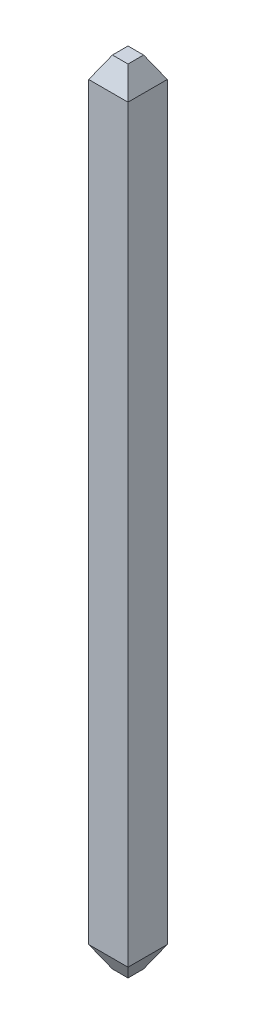
ISO-10303-21;
HEADER;
FILE_DESCRIPTION(('STEP AP214'),'2;1');
FILE_NAME('part.step','',(''),(''),'','','');
FILE_SCHEMA(('AUTOMOTIVE_DESIGN { 1 0 10303 214 1 1 1 1 }'));
ENDSEC;
DATA;
#1=APPLICATION_CONTEXT('core data for automotive mechanical design processes');
#2=APPLICATION_PROTOCOL_DEFINITION('international standard','automotive_design',2000,#1);
#3=PRODUCT_CONTEXT('',#1,'mechanical');
#4=PRODUCT('Part','Part','',(#3));
#5=PRODUCT_RELATED_PRODUCT_CATEGORY('part','',(#4));
#6=PRODUCT_DEFINITION_FORMATION('','',#4);
#7=PRODUCT_DEFINITION_CONTEXT('part definition',#1,'design');
#8=PRODUCT_DEFINITION('design','',#6,#7);
#9=PRODUCT_DEFINITION_SHAPE('','',#8);
#10=(LENGTH_UNIT() NAMED_UNIT(*) SI_UNIT(.MILLI.,.METRE.));
#11=(NAMED_UNIT(*) PLANE_ANGLE_UNIT() SI_UNIT($,.RADIAN.));
#12=(NAMED_UNIT(*) SI_UNIT($,.STERADIAN.) SOLID_ANGLE_UNIT());
#13=UNCERTAINTY_MEASURE_WITH_UNIT(LENGTH_MEASURE(1.E-05),#10,'distance_accuracy_value','');
#14=(GEOMETRIC_REPRESENTATION_CONTEXT(3) GLOBAL_UNCERTAINTY_ASSIGNED_CONTEXT((#13)) GLOBAL_UNIT_ASSIGNED_CONTEXT((#10,
#11,#12)) REPRESENTATION_CONTEXT('',''));
#15=CARTESIAN_POINT('',(0.,0.,0.));
#16=DIRECTION('',(0.,0.,1.));
#17=DIRECTION('',(1.,0.,0.));
#18=AXIS2_PLACEMENT_3D('',#15,#16,#17);
#19=CARTESIAN_POINT('',(0.497289871213,-21.22226807941,9.869039407632));
#20=DIRECTION('',(0.,0.488489958076213,0.87256951634738));
#21=DIRECTION('',(0.,-0.87256951634738,0.488489958076213));
#22=AXIS2_PLACEMENT_3D('',#19,#20,#21);
#23=PLANE('',#22);
#24=DIRECTION('',(1.,0.,0.));
#25=VECTOR('',#24,1.);
#26=CARTESIAN_POINT('',(0.497289871213,-21.57099360271,10.0642661638579));
#27=LINE('',#26,#25);
#28=CARTESIAN_POINT('',(0.48728989589798,-21.5709939289416,10.0642661638454));
#29=VERTEX_POINT('',#28);
#30=CARTESIAN_POINT('',(-0.142710289145667,-21.5709938896675,10.0642663245045));
#31=VERTEX_POINT('',#30);
#32=EDGE_CURVE('E118',#29,#31,#27,.F.);
#33=ORIENTED_EDGE('',*,*,#32,.F.);
#34=DIRECTION('',(0.438284036988266,-0.784297353956642,0.439072617567844));
#35=VECTOR('',#34,1.);
#36=CARTESIAN_POINT('',(0.29728987121219,-21.2309937745705,9.873924307213));
#37=LINE('',#36,#35);
#38=CARTESIAN_POINT('',(0.297289871212797,-21.2309937745703,9.87392430721258));
#39=VERTEX_POINT('',#38);
#40=EDGE_CURVE('E116',#39,#29,#37,.T.);
#41=ORIENTED_EDGE('',*,*,#40,.F.);
#42=DIRECTION('',(-1.,0.,0.));
#43=VECTOR('',#42,1.);
#44=CARTESIAN_POINT('',(0.307289871213,-21.23099377457,9.873924307213));
#45=LINE('',#44,#43);
#46=CARTESIAN_POINT('',(0.0472898712130297,-21.2309937745702,9.87392430721258));
#47=VERTEX_POINT('',#46);
#48=EDGE_CURVE('E79',#47,#39,#45,.F.);
#49=ORIENTED_EDGE('',*,*,#48,.F.);
#50=DIRECTION('',(0.438284036988272,0.784297353956654,-0.439072617567815));
#51=VECTOR('',#50,1.);
#52=CARTESIAN_POINT('',(-0.14271012878781,-21.5709936027095,10.064266163858));
#53=LINE('',#52,#51);
#54=EDGE_CURVE('E110',#31,#47,#53,.T.);
#55=ORIENTED_EDGE('',*,*,#54,.F.);
#56=EDGE_LOOP('',(#33,#41,#49,#55));
#57=FACE_BOUND('',#56,.T.);
#58=ADVANCED_FACE('F17',(#57),#23,.T.);
#59=CARTESIAN_POINT('',(0.497289871213,-33.93541112064,9.869291335356));
#60=DIRECTION('',(0.,-0.487152273933216,0.873317045523387));
#61=DIRECTION('',(0.,-0.873317045523387,-0.487152273933216));
#62=AXIS2_PLACEMENT_3D('',#59,#60,#61);
#63=PLANE('',#62);
#64=DIRECTION('',(-0.438586917260297,-0.784839349958943,-0.437799852403052));
#65=VECTOR('',#64,1.);
#66=CARTESIAN_POINT('',(0.487290184384019,-33.5866775616409,10.063822206765));
#67=LINE('',#66,#65);
#68=CARTESIAN_POINT('',(0.487289980136551,-33.5866774630266,10.0638219617617));
#69=VERTEX_POINT('',#68);
#70=CARTESIAN_POINT('',(0.29728987121302,-33.9266779501895,9.87416285809402));
#71=VERTEX_POINT('',#70);
#72=EDGE_CURVE('E122',#69,#71,#67,.T.);
#73=ORIENTED_EDGE('',*,*,#72,.F.);
#74=DIRECTION('',(1.,0.,0.));
#75=VECTOR('',#74,1.);
#76=CARTESIAN_POINT('',(0.497289871213,-33.5866774970136,10.0638228462197));
#77=LINE('',#76,#75);
#78=CARTESIAN_POINT('',(-0.142710305819022,-33.5866774872793,10.0638219600164));
#79=VERTEX_POINT('',#78);
#80=EDGE_CURVE('E89',#79,#69,#77,.T.);
#81=ORIENTED_EDGE('',*,*,#80,.F.);
#82=DIRECTION('',(-0.438586917260198,0.784839349958761,0.437799852403477));
#83=VECTOR('',#82,1.);
#84=CARTESIAN_POINT('',(0.0472898712136261,-33.9266779501897,9.874162858095));
#85=LINE('',#84,#83);
#86=CARTESIAN_POINT('',(0.0472898712132013,-33.9266779501894,9.87416285809402));
#87=VERTEX_POINT('',#86);
#88=EDGE_CURVE('E84',#87,#79,#85,.T.);
#89=ORIENTED_EDGE('',*,*,#88,.F.);
#90=DIRECTION('',(1.,0.,0.));
#91=VECTOR('',#90,1.);
#92=CARTESIAN_POINT('',(0.03728987121306,-33.92667795019,9.874162858095));
#93=LINE('',#92,#91);
#94=EDGE_CURVE('E20',#71,#87,#93,.F.);
#95=ORIENTED_EDGE('',*,*,#94,.F.);
#96=EDGE_LOOP('',(#73,#81,#89,#95));
#97=FACE_BOUND('',#96,.T.);
#98=ADVANCED_FACE('F86',(#97),#63,.T.);
#99=CARTESIAN_POINT('',(0.03728987121306,-33.92667795019,9.614162858095));
#100=DIRECTION('',(0.,-1.,0.));
#101=DIRECTION('',(1.,0.,0.));
#102=AXIS2_PLACEMENT_3D('',#99,#100,#101);
#103=PLANE('',#102);
#104=DIRECTION('',(0.,0.,1.));
#105=VECTOR('',#104,1.);
#106=CARTESIAN_POINT('',(0.0472898712136262,-33.9266779501897,9.423821001451));
#107=LINE('',#106,#105);
#108=CARTESIAN_POINT('',(0.0472898712133431,-33.9266779501896,9.62416285809542));
#109=VERTEX_POINT('',#108);
#110=EDGE_CURVE('E93',#109,#87,#107,.T.);
#111=ORIENTED_EDGE('',*,*,#110,.F.);
#112=DIRECTION('',(1.,0.,0.));
#113=VECTOR('',#112,1.);
#114=CARTESIAN_POINT('',(0.497289871213,-33.9266779501891,9.62416285809666));
#115=LINE('',#114,#113);
#116=CARTESIAN_POINT('',(0.29728987121304,-33.9266779501898,9.62416285809542));
#117=VERTEX_POINT('',#116);
#118=EDGE_CURVE('E129',#117,#109,#115,.F.);
#119=ORIENTED_EDGE('',*,*,#118,.F.);
#120=DIRECTION('',(0.,0.,1.));
#121=VECTOR('',#120,1.);
#122=CARTESIAN_POINT('',(0.297289871213079,-33.92667795019,9.423821001451));
#123=LINE('',#122,#121);
#124=EDGE_CURVE('E98',#71,#117,#123,.F.);
#125=ORIENTED_EDGE('',*,*,#124,.F.);
#126=ORIENTED_EDGE('',*,*,#94,.T.);
#127=EDGE_LOOP('',(#111,#119,#125,#126));
#128=FACE_BOUND('',#127,.T.);
#129=ADVANCED_FACE('F95',(#128),#103,.T.);
#130=CARTESIAN_POINT('',(0.05216808666874,-33.93540738396,9.423821001451));
#131=DIRECTION('',(-0.872943377132686,-0.487821545567825,0.));
#132=DIRECTION('',(0.487821545567825,-0.872943377132686,0.));
#133=AXIS2_PLACEMENT_3D('',#130,#131,#132);
#134=PLANE('',#133);
#135=DIRECTION('',(-0.43828470044216,0.784297071672232,-0.439072459537932));
#136=VECTOR('',#135,1.);
#137=CARTESIAN_POINT('',(0.04728987121306,-33.9266779501891,9.62416285809666));
#138=LINE('',#137,#136);
#139=CARTESIAN_POINT('',(-0.142710211258917,-33.5866782459584,9.43382181091626));
#140=VERTEX_POINT('',#139);
#141=EDGE_CURVE('E102',#109,#140,#138,.T.);
#142=ORIENTED_EDGE('',*,*,#141,.F.);
#143=ORIENTED_EDGE('',*,*,#110,.T.);
#144=ORIENTED_EDGE('',*,*,#88,.T.);
#145=DIRECTION('',(0.,0.,1.));
#146=VECTOR('',#145,1.);
#147=CARTESIAN_POINT('',(-0.142710128787,-33.58667874778,9.748990896586));
#148=LINE('',#147,#146);
#149=EDGE_CURVE('E131',#140,#79,#148,.T.);
#150=ORIENTED_EDGE('',*,*,#149,.F.);
#151=EDGE_LOOP('',(#142,#143,#144,#150));
#152=FACE_BOUND('',#151,.T.);
#153=ADVANCED_FACE('F100',(#152),#134,.T.);
#154=CARTESIAN_POINT('',(0.307289871213,-21.23099377457,9.613924307213));
#155=DIRECTION('',(0.,1.,0.));
#156=DIRECTION('',(-1.,0.,0.));
#157=AXIS2_PLACEMENT_3D('',#154,#155,#156);
#158=PLANE('',#157);
#159=ORIENTED_EDGE('',*,*,#48,.T.);
#160=DIRECTION('',(0.,0.,1.));
#161=VECTOR('',#160,1.);
#162=CARTESIAN_POINT('',(0.29728987121219,-21.2309937745705,9.424266163858));
#163=LINE('',#162,#161);
#164=CARTESIAN_POINT('',(0.297289871212797,-21.2309937745704,9.62392430721349));
#165=VERTEX_POINT('',#164);
#166=EDGE_CURVE('E113',#165,#39,#163,.T.);
#167=ORIENTED_EDGE('',*,*,#166,.F.);
#168=DIRECTION('',(1.,0.,0.));
#169=VECTOR('',#168,1.);
#170=CARTESIAN_POINT('',(0.497289871213,-21.2309937745711,9.62392430721497));
#171=LINE('',#170,#169);
#172=CARTESIAN_POINT('',(0.0472898712130296,-21.2309937745703,9.62392430721349));
#173=VERTEX_POINT('',#172);
#174=EDGE_CURVE('E140',#173,#165,#171,.T.);
#175=ORIENTED_EDGE('',*,*,#174,.F.);
#176=DIRECTION('',(0.,0.,1.));
#177=VECTOR('',#176,1.);
#178=CARTESIAN_POINT('',(0.0472898712129385,-21.2309937745699,9.424266163858));
#179=LINE('',#178,#177);
#180=EDGE_CURVE('E105',#47,#173,#179,.F.);
#181=ORIENTED_EDGE('',*,*,#180,.F.);
#182=EDGE_LOOP('',(#159,#167,#175,#181));
#183=FACE_BOUND('',#182,.T.);
#184=ADVANCED_FACE('F184',(#183),#158,.T.);
#185=CARTESIAN_POINT('',(-0.147588344243,-21.57972303648,9.424266163858));
#186=DIRECTION('',(-0.872943377132686,0.487821545567825,0.));
#187=DIRECTION('',(-0.487821545567825,-0.872943377132686,0.));
#188=AXIS2_PLACEMENT_3D('',#185,#186,#187);
#189=PLANE('',#188);
#190=DIRECTION('',(0.,0.,1.));
#191=VECTOR('',#190,1.);
#192=CARTESIAN_POINT('',(-0.142710128787008,-21.57099360271,9.748990896586));
#193=LINE('',#192,#191);
#194=CARTESIAN_POINT('',(-0.142710835596165,-21.5709953440113,9.43426575489926));
#195=VERTEX_POINT('',#194);
#196=EDGE_CURVE('E137',#31,#195,#193,.F.);
#197=ORIENTED_EDGE('',*,*,#196,.F.);
#198=ORIENTED_EDGE('',*,*,#54,.T.);
#199=ORIENTED_EDGE('',*,*,#180,.T.);
#200=DIRECTION('',(0.438586429090239,0.784840434712888,0.437798396819309));
#201=VECTOR('',#200,1.);
#202=CARTESIAN_POINT('',(-0.142710849418,-21.5709957406264,9.43426497129039));
#203=LINE('',#202,#201);
#204=EDGE_CURVE('E145',#195,#173,#203,.T.);
#205=ORIENTED_EDGE('',*,*,#204,.F.);
#206=EDGE_LOOP('',(#197,#198,#199,#205));
#207=FACE_BOUND('',#206,.T.);
#208=ADVANCED_FACE('F182',(#207),#189,.T.);
#209=CARTESIAN_POINT('',(0.292411655757,-21.2222643408,9.424266163858));
#210=DIRECTION('',(0.872943377132686,0.487821545567825,0.));
#211=DIRECTION('',(-0.487821545567825,0.872943377132686,0.));
#212=AXIS2_PLACEMENT_3D('',#209,#210,#211);
#213=PLANE('',#212);
#214=ORIENTED_EDGE('',*,*,#166,.T.);
#215=ORIENTED_EDGE('',*,*,#40,.T.);
#216=DIRECTION('',(0.,0.,1.));
#217=VECTOR('',#216,1.);
#218=CARTESIAN_POINT('',(0.487289871212996,-21.57099621256,9.423872654069));
#219=LINE('',#218,#217);
#220=CARTESIAN_POINT('',(0.487290141449586,-21.5709947896532,9.43426628939785));
#221=VERTEX_POINT('',#220);
#222=EDGE_CURVE('E35',#221,#29,#219,.T.);
#223=ORIENTED_EDGE('',*,*,#222,.F.);
#224=DIRECTION('',(0.43858642909013,-0.784840434712933,-0.437798396819338));
#225=VECTOR('',#224,1.);
#226=CARTESIAN_POINT('',(0.297289871213,-21.2309937745711,9.62392430721497));
#227=LINE('',#226,#225);
#228=EDGE_CURVE('E143',#165,#221,#227,.T.);
#229=ORIENTED_EDGE('',*,*,#228,.F.);
#230=EDGE_LOOP('',(#214,#215,#223,#229));
#231=FACE_BOUND('',#230,.T.);
#232=ADVANCED_FACE('F185',(#231),#213,.T.);
#233=CARTESIAN_POINT('',(0.497289871213,-21.45033675752,10.064270615482));
#234=DIRECTION('',(0.,-3.68949151673641E-05,0.999999999319383));
#235=DIRECTION('',(0.,-0.999999999319383,-3.68949151673641E-05));
#236=AXIS2_PLACEMENT_3D('',#233,#234,#235);
#237=PLANE('',#236);
#238=DIRECTION('',(0.,0.999999999317418,3.69481335065462E-05));
#239=VECTOR('',#238,1.);
#240=CARTESIAN_POINT('',(-0.142710128787,-33.58667749699,10.063822206765));
#241=LINE('',#240,#239);
#242=EDGE_CURVE('E134',#79,#31,#241,.T.);
#243=ORIENTED_EDGE('',*,*,#242,.F.);
#244=ORIENTED_EDGE('',*,*,#80,.T.);
#245=DIRECTION('',(0.,-0.999999999317418,-3.69481335065462E-05));
#246=VECTOR('',#245,1.);
#247=CARTESIAN_POINT('',(0.487289871212996,-21.57099360271,10.064266163858));
#248=LINE('',#247,#246);
#249=EDGE_CURVE('E149',#29,#69,#248,.T.);
#250=ORIENTED_EDGE('',*,*,#249,.F.);
#251=ORIENTED_EDGE('',*,*,#32,.T.);
#252=EDGE_LOOP('',(#243,#244,#250,#251));
#253=FACE_BOUND('',#252,.T.);
#254=ADVANCED_FACE('F187',(#253),#237,.T.);
#255=CARTESIAN_POINT('',(0.492168086669,-33.57794868828,9.423821001451));
#256=DIRECTION('',(0.872943377132686,-0.487821545567825,0.));
#257=DIRECTION('',(0.487821545567825,0.872943377132686,0.));
#258=AXIS2_PLACEMENT_3D('',#255,#256,#257);
#259=PLANE('',#258);
#260=ORIENTED_EDGE('',*,*,#124,.T.);
#261=DIRECTION('',(-0.438284700442049,-0.784297071672281,0.439072459537955));
#262=VECTOR('',#261,1.);
#263=CARTESIAN_POINT('',(0.487289673578,-33.5866791127601,9.43382155607999));
#264=LINE('',#263,#262);
#265=CARTESIAN_POINT('',(0.487289755137329,-33.5866786503075,9.43382212481551));
#266=VERTEX_POINT('',#265);
#267=EDGE_CURVE('E126',#266,#117,#264,.T.);
#268=ORIENTED_EDGE('',*,*,#267,.F.);
#269=DIRECTION('',(0.,0.,1.));
#270=VECTOR('',#269,1.);
#271=CARTESIAN_POINT('',(0.487289871213004,-33.58667749699,9.423872654069));
#272=LINE('',#271,#270);
#273=EDGE_CURVE('E152',#69,#266,#272,.F.);
#274=ORIENTED_EDGE('',*,*,#273,.F.);
#275=ORIENTED_EDGE('',*,*,#72,.T.);
#276=EDGE_LOOP('',(#260,#268,#274,#275));
#277=FACE_BOUND('',#276,.T.);
#278=ADVANCED_FACE('F174',(#277),#259,.T.);
#279=CARTESIAN_POINT('',(0.497289871213,-33.93540364535,9.629047757676));
#280=DIRECTION('',(0.,-0.488489958076213,-0.87256951634738));
#281=DIRECTION('',(0.,0.87256951634738,-0.488489958076213));
#282=AXIS2_PLACEMENT_3D('',#279,#280,#281);
#283=PLANE('',#282);
#284=ORIENTED_EDGE('',*,*,#267,.T.);
#285=ORIENTED_EDGE('',*,*,#118,.T.);
#286=ORIENTED_EDGE('',*,*,#141,.T.);
#287=DIRECTION('',(1.,0.,0.));
#288=VECTOR('',#287,1.);
#289=CARTESIAN_POINT('',(0.497289871213,-33.5866787478035,9.43382284617289));
#290=LINE('',#289,#288);
#291=EDGE_CURVE('E155',#266,#140,#290,.F.);
#292=ORIENTED_EDGE('',*,*,#291,.F.);
#293=EDGE_LOOP('',(#284,#285,#286,#292));
#294=FACE_BOUND('',#293,.T.);
#295=ADVANCED_FACE('F177',(#294),#283,.T.);
#296=CARTESIAN_POINT('',(-0.142710128787,-33.75733847732,9.748990896586));
#297=DIRECTION('',(-1.,0.,0.));
#298=DIRECTION('',(0.,-1.,0.));
#299=AXIS2_PLACEMENT_3D('',#296,#297,#298);
#300=PLANE('',#299);
#301=ORIENTED_EDGE('',*,*,#196,.T.);
#302=DIRECTION('',(0.,0.999999999319383,3.68949151675341E-05));
#303=VECTOR('',#302,1.);
#304=CARTESIAN_POINT('',(-0.142709931152,-33.75734199129,9.433816549567));
#305=LINE('',#304,#303);
#306=EDGE_CURVE('E158',#140,#195,#305,.T.);
#307=ORIENTED_EDGE('',*,*,#306,.F.);
#308=ORIENTED_EDGE('',*,*,#149,.T.);
#309=ORIENTED_EDGE('',*,*,#242,.T.);
#310=EDGE_LOOP('',(#301,#307,#308,#309));
#311=FACE_BOUND('',#310,.T.);
#312=ADVANCED_FACE('F179',(#311),#300,.T.);
#313=CARTESIAN_POINT('',(0.497289871213,-21.22226060412,9.628795829952));
#314=DIRECTION('',(0.,0.487152273933216,-0.873317045523387));
#315=DIRECTION('',(0.,0.873317045523387,0.487152273933216));
#316=AXIS2_PLACEMENT_3D('',#313,#314,#315);
#317=PLANE('',#316);
#318=DIRECTION('',(1.,0.,0.));
#319=VECTOR('',#318,1.);
#320=CARTESIAN_POINT('',(0.497289871213,-21.5709962125728,9.43426616376101));
#321=LINE('',#320,#319);
#322=EDGE_CURVE('E26',#195,#221,#321,.T.);
#323=ORIENTED_EDGE('',*,*,#322,.F.);
#324=ORIENTED_EDGE('',*,*,#204,.T.);
#325=ORIENTED_EDGE('',*,*,#174,.T.);
#326=ORIENTED_EDGE('',*,*,#228,.T.);
#327=EDGE_LOOP('',(#323,#324,#325,#326));
#328=FACE_BOUND('',#327,.T.);
#329=ADVANCED_FACE('F168',(#328),#317,.T.);
#330=CARTESIAN_POINT('',(0.487289871213,-27.60384299983,9.423872654069));
#331=DIRECTION('',(1.,0.,0.));
#332=DIRECTION('',(0.,1.,0.));
#333=AXIS2_PLACEMENT_3D('',#330,#331,#332);
#334=PLANE('',#333);
#335=ORIENTED_EDGE('',*,*,#249,.T.);
#336=ORIENTED_EDGE('',*,*,#273,.T.);
#337=DIRECTION('',(0.,0.999999999319383,3.68949151675341E-05));
#338=VECTOR('',#337,1.);
#339=CARTESIAN_POINT('',(0.487290591844,-33.75734199129,9.433816549567));
#340=LINE('',#339,#338);
#341=EDGE_CURVE('E11',#221,#266,#340,.F.);
#342=ORIENTED_EDGE('',*,*,#341,.F.);
#343=ORIENTED_EDGE('',*,*,#222,.T.);
#344=EDGE_LOOP('',(#335,#336,#342,#343));
#345=FACE_BOUND('',#344,.T.);
#346=ADVANCED_FACE('F170',(#345),#334,.T.);
#347=CARTESIAN_POINT('',(0.497289871213,-33.75734199129,9.433816549567));
#348=DIRECTION('',(0.,3.68949151675341E-05,-0.999999999319383));
#349=DIRECTION('',(0.,0.999999999319383,3.68949151675341E-05));
#350=AXIS2_PLACEMENT_3D('',#347,#348,#349);
#351=PLANE('',#350);
#352=ORIENTED_EDGE('',*,*,#322,.T.);
#353=ORIENTED_EDGE('',*,*,#341,.T.);
#354=ORIENTED_EDGE('',*,*,#291,.T.);
#355=ORIENTED_EDGE('',*,*,#306,.T.);
#356=EDGE_LOOP('',(#352,#353,#354,#355));
#357=FACE_BOUND('',#356,.T.);
#358=ADVANCED_FACE('F164',(#357),#351,.T.);
#359=CLOSED_SHELL('',(#58,#98,#129,#153,#184,#208,#232,#254,#278,#295,#312,#329,#346,#358));
#360=MANIFOLD_SOLID_BREP('B1',#359);
#361=ADVANCED_BREP_SHAPE_REPRESENTATION('',(#18,#360),#14);
#362=SHAPE_DEFINITION_REPRESENTATION(#9,#361);
ENDSEC;
END-ISO-10303-21;
